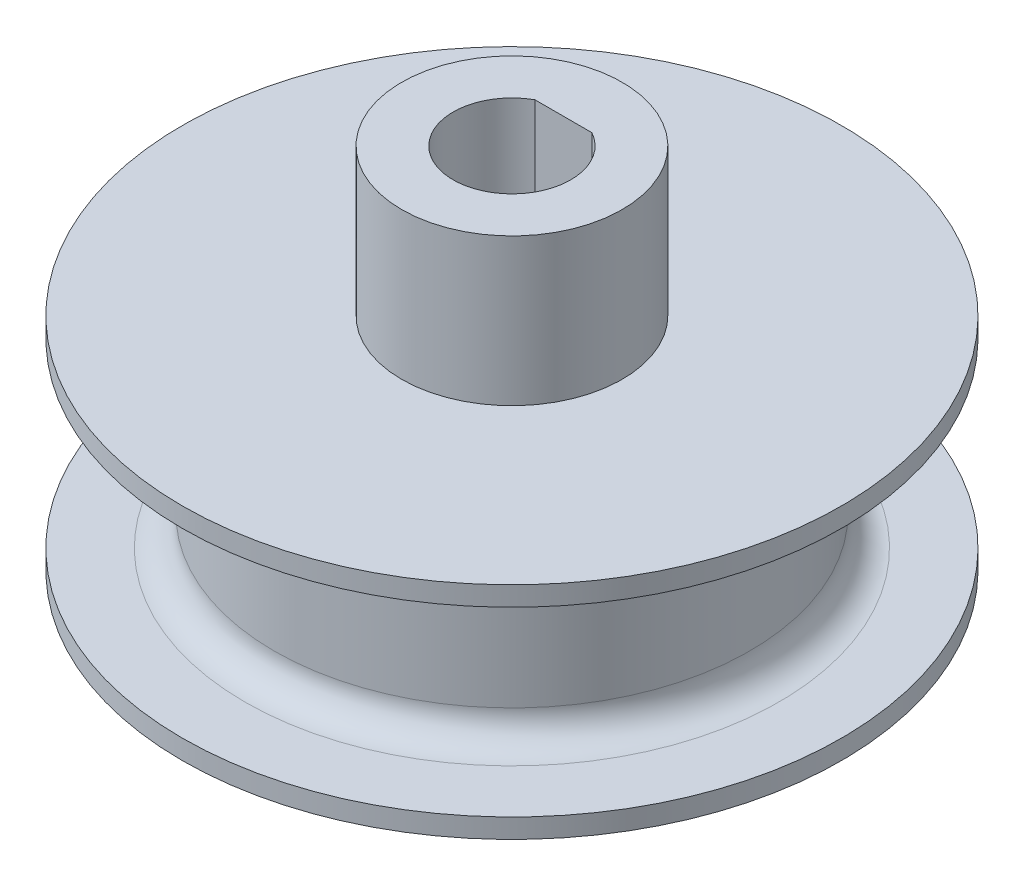
ISO-10303-21;
HEADER;
FILE_DESCRIPTION(('STEP AP214'),'2;1');
FILE_NAME('part.step','',(''),(''),'','','');
FILE_SCHEMA(('AUTOMOTIVE_DESIGN { 1 0 10303 214 1 1 1 1 }'));
ENDSEC;
DATA;
#1=APPLICATION_CONTEXT('core data for automotive mechanical design processes');
#2=APPLICATION_PROTOCOL_DEFINITION('international standard','automotive_design',2000,#1);
#3=PRODUCT_CONTEXT('',#1,'mechanical');
#4=PRODUCT('Part','Part','',(#3));
#5=PRODUCT_RELATED_PRODUCT_CATEGORY('part','',(#4));
#6=PRODUCT_DEFINITION_FORMATION('','',#4);
#7=PRODUCT_DEFINITION_CONTEXT('part definition',#1,'design');
#8=PRODUCT_DEFINITION('design','',#6,#7);
#9=PRODUCT_DEFINITION_SHAPE('','',#8);
#10=(LENGTH_UNIT() NAMED_UNIT(*) SI_UNIT(.MILLI.,.METRE.));
#11=(NAMED_UNIT(*) PLANE_ANGLE_UNIT() SI_UNIT($,.RADIAN.));
#12=(NAMED_UNIT(*) SI_UNIT($,.STERADIAN.) SOLID_ANGLE_UNIT());
#13=UNCERTAINTY_MEASURE_WITH_UNIT(LENGTH_MEASURE(1.E-05),#10,'distance_accuracy_value','');
#14=(GEOMETRIC_REPRESENTATION_CONTEXT(3) GLOBAL_UNCERTAINTY_ASSIGNED_CONTEXT((#13)) GLOBAL_UNIT_ASSIGNED_CONTEXT((#10,
#11,#12)) REPRESENTATION_CONTEXT('',''));
#15=CARTESIAN_POINT('',(0.,0.,0.));
#16=DIRECTION('',(0.,0.,1.));
#17=DIRECTION('',(1.,0.,0.));
#18=AXIS2_PLACEMENT_3D('',#15,#16,#17);
#19=CARTESIAN_POINT('',(0.,7.5,0.));
#20=DIRECTION('',(0.,-1.,0.));
#21=DIRECTION('',(0.,0.,-1.));
#22=AXIS2_PLACEMENT_3D('',#19,#20,#21);
#23=CYLINDRICAL_SURFACE('',#22,4.);
#24=CARTESIAN_POINT('',(0.,-7.5,0.));
#25=DIRECTION('',(0.,1.,0.));
#26=DIRECTION('',(0.,0.,1.));
#27=AXIS2_PLACEMENT_3D('',#24,#25,#26);
#28=CIRCLE('',#27,4.);
#29=CARTESIAN_POINT('',(-1.93649167310371,-7.5,-3.5));
#30=VERTEX_POINT('',#29);
#31=CARTESIAN_POINT('',(1.93649167310371,-7.5,-3.5));
#32=VERTEX_POINT('',#31);
#33=EDGE_CURVE('E71',#30,#32,#28,.T.);
#34=ORIENTED_EDGE('',*,*,#33,.F.);
#35=DIRECTION('',(0.,-1.,0.));
#36=VECTOR('',#35,1.);
#37=CARTESIAN_POINT('',(-1.93649167310371,7.5,-3.5));
#38=LINE('',#37,#36);
#39=CARTESIAN_POINT('',(-1.93649167310371,17.5,-3.5));
#40=VERTEX_POINT('',#39);
#41=EDGE_CURVE('E11',#40,#30,#38,.T.);
#42=ORIENTED_EDGE('',*,*,#41,.F.);
#43=CARTESIAN_POINT('',(0.,17.5,0.));
#44=DIRECTION('',(0.,1.,0.));
#45=DIRECTION('',(0.,0.,1.));
#46=AXIS2_PLACEMENT_3D('',#43,#44,#45);
#47=CIRCLE('',#46,4.);
#48=CARTESIAN_POINT('',(1.93649167310371,17.5,-3.5));
#49=VERTEX_POINT('',#48);
#50=EDGE_CURVE('E70',#40,#49,#47,.T.);
#51=ORIENTED_EDGE('',*,*,#50,.T.);
#52=DIRECTION('',(0.,-1.,0.));
#53=VECTOR('',#52,1.);
#54=CARTESIAN_POINT('',(1.93649167310371,7.5,-3.5));
#55=LINE('',#54,#53);
#56=EDGE_CURVE('E53',#49,#32,#55,.T.);
#57=ORIENTED_EDGE('',*,*,#56,.T.);
#58=EDGE_LOOP('',(#34,#42,#51,#57));
#59=FACE_BOUND('',#58,.T.);
#60=ADVANCED_FACE('F45',(#59),#23,.F.);
#61=CARTESIAN_POINT('',(0.,7.5,-3.5));
#62=DIRECTION('',(0.,0.,1.));
#63=DIRECTION('',(1.,0.,0.));
#64=AXIS2_PLACEMENT_3D('',#61,#62,#63);
#65=PLANE('',#64);
#66=DIRECTION('',(-1.,0.,0.));
#67=VECTOR('',#66,1.);
#68=CARTESIAN_POINT('',(0.,-7.5,-3.5));
#69=LINE('',#68,#67);
#70=EDGE_CURVE('E126',#32,#30,#69,.T.);
#71=ORIENTED_EDGE('',*,*,#70,.F.);
#72=ORIENTED_EDGE('',*,*,#56,.F.);
#73=DIRECTION('',(1.,0.,0.));
#74=VECTOR('',#73,1.);
#75=CARTESIAN_POINT('',(0.,17.5,-3.5));
#76=LINE('',#75,#74);
#77=EDGE_CURVE('E74',#40,#49,#76,.T.);
#78=ORIENTED_EDGE('',*,*,#77,.F.);
#79=ORIENTED_EDGE('',*,*,#41,.T.);
#80=EDGE_LOOP('',(#71,#72,#78,#79));
#81=FACE_BOUND('',#80,.T.);
#82=ADVANCED_FACE('F75',(#81),#65,.T.);
#83=CARTESIAN_POINT('',(0.,7.5,0.));
#84=DIRECTION('',(0.,1.,0.));
#85=DIRECTION('',(0.,0.,1.));
#86=AXIS2_PLACEMENT_3D('',#83,#84,#85);
#87=PLANE('',#86);
#88=CARTESIAN_POINT('',(0.,7.5,0.));
#89=DIRECTION('',(0.,1.,0.));
#90=DIRECTION('',(0.,0.,1.));
#91=AXIS2_PLACEMENT_3D('',#88,#89,#90);
#92=CIRCLE('',#91,7.5);
#93=CARTESIAN_POINT('',(0.,7.5,7.5));
#94=VERTEX_POINT('',#93);
#95=EDGE_CURVE('E83',#94,#94,#92,.T.);
#96=ORIENTED_EDGE('',*,*,#95,.F.);
#97=EDGE_LOOP('',(#96));
#98=FACE_BOUND('',#97,.T.);
#99=CARTESIAN_POINT('',(0.,7.5,0.));
#100=DIRECTION('',(0.,1.,0.));
#101=DIRECTION('',(0.,0.,1.));
#102=AXIS2_PLACEMENT_3D('',#99,#100,#101);
#103=CIRCLE('',#102,22.4137232347134);
#104=CARTESIAN_POINT('',(0.,7.5,22.4137232347134));
#105=VERTEX_POINT('',#104);
#106=EDGE_CURVE('E112',#105,#105,#103,.T.);
#107=ORIENTED_EDGE('',*,*,#106,.T.);
#108=EDGE_LOOP('',(#107));
#109=FACE_BOUND('',#108,.T.);
#110=ADVANCED_FACE('F134',(#98,#109),#87,.T.);
#111=CARTESIAN_POINT('',(0.,-7.5,0.));
#112=DIRECTION('',(0.,1.,0.));
#113=DIRECTION('',(0.,0.,1.));
#114=AXIS2_PLACEMENT_3D('',#111,#112,#113);
#115=PLANE('',#114);
#116=ORIENTED_EDGE('',*,*,#33,.T.);
#117=ORIENTED_EDGE('',*,*,#70,.T.);
#118=EDGE_LOOP('',(#116,#117));
#119=FACE_BOUND('',#118,.T.);
#120=CARTESIAN_POINT('',(0.,-7.5,0.));
#121=DIRECTION('',(0.,1.,0.));
#122=DIRECTION('',(0.,0.,1.));
#123=AXIS2_PLACEMENT_3D('',#120,#121,#122);
#124=CIRCLE('',#123,22.4137232347134);
#125=CARTESIAN_POINT('',(0.,-7.5,22.4137232347134));
#126=VERTEX_POINT('',#125);
#127=EDGE_CURVE('E108',#126,#126,#124,.T.);
#128=ORIENTED_EDGE('',*,*,#127,.F.);
#129=EDGE_LOOP('',(#128));
#130=FACE_BOUND('',#129,.T.);
#131=ADVANCED_FACE('F130',(#119,#130),#115,.F.);
#132=CARTESIAN_POINT('',(0.,4.176007767818,0.));
#133=DIRECTION('',(0.,1.,0.));
#134=DIRECTION('',(0.,0.,1.));
#135=AXIS2_PLACEMENT_3D('',#132,#133,#134);
#136=TOROIDAL_SURFACE('',#135,18.1594784829378,2.);
#137=CARTESIAN_POINT('',(0.,4.176007767818,0.));
#138=DIRECTION('',(0.,1.,0.));
#139=DIRECTION('',(0.,0.,1.));
#140=AXIS2_PLACEMENT_3D('',#137,#138,#139);
#141=CIRCLE('',#140,16.1594784829378);
#142=CARTESIAN_POINT('',(0.,4.176007767818,16.1594784829378));
#143=VERTEX_POINT('',#142);
#144=EDGE_CURVE('E91',#143,#143,#141,.T.);
#145=ORIENTED_EDGE('',*,*,#144,.T.);
#146=EDGE_LOOP('',(#145));
#147=FACE_BOUND('',#146,.T.);
#148=CARTESIAN_POINT('',(0.,6.176007767818,0.));
#149=DIRECTION('',(0.,1.,0.));
#150=DIRECTION('',(0.,0.,1.));
#151=AXIS2_PLACEMENT_3D('',#148,#149,#150);
#152=CIRCLE('',#151,18.1594784829378);
#153=CARTESIAN_POINT('',(0.,6.176007767818,18.1594784829378));
#154=VERTEX_POINT('',#153);
#155=EDGE_CURVE('E120',#154,#154,#152,.T.);
#156=ORIENTED_EDGE('',*,*,#155,.F.);
#157=EDGE_LOOP('',(#156));
#158=FACE_BOUND('',#157,.T.);
#159=ADVANCED_FACE('F133',(#147,#158),#136,.F.);
#160=CARTESIAN_POINT('',(0.,6.176007767818,0.));
#161=DIRECTION('',(0.,-1.,0.));
#162=DIRECTION('',(0.,0.,-1.));
#163=AXIS2_PLACEMENT_3D('',#160,#161,#162);
#164=PLANE('',#163);
#165=ORIENTED_EDGE('',*,*,#155,.T.);
#166=EDGE_LOOP('',(#165));
#167=FACE_BOUND('',#166,.T.);
#168=CARTESIAN_POINT('',(0.,6.176007767818,0.));
#169=DIRECTION('',(0.,1.,0.));
#170=DIRECTION('',(0.,0.,1.));
#171=AXIS2_PLACEMENT_3D('',#168,#169,#170);
#172=CIRCLE('',#171,22.4137232347134);
#173=CARTESIAN_POINT('',(0.,6.176007767818,22.4137232347134));
#174=VERTEX_POINT('',#173);
#175=EDGE_CURVE('E116',#174,#174,#172,.T.);
#176=ORIENTED_EDGE('',*,*,#175,.F.);
#177=EDGE_LOOP('',(#176));
#178=FACE_BOUND('',#177,.T.);
#179=ADVANCED_FACE('F166',(#167,#178),#164,.T.);
#180=CARTESIAN_POINT('',(0.,7.5,0.));
#181=DIRECTION('',(0.,1.,0.));
#182=DIRECTION('',(0.,0.,1.));
#183=AXIS2_PLACEMENT_3D('',#180,#181,#182);
#184=CYLINDRICAL_SURFACE('',#183,22.4137232347134);
#185=ORIENTED_EDGE('',*,*,#175,.T.);
#186=EDGE_LOOP('',(#185));
#187=FACE_BOUND('',#186,.T.);
#188=ORIENTED_EDGE('',*,*,#106,.F.);
#189=EDGE_LOOP('',(#188));
#190=FACE_BOUND('',#189,.T.);
#191=ADVANCED_FACE('F142',(#187,#190),#184,.T.);
#192=CARTESIAN_POINT('',(0.,7.5,0.));
#193=DIRECTION('',(0.,1.,0.));
#194=DIRECTION('',(0.,0.,1.));
#195=AXIS2_PLACEMENT_3D('',#192,#193,#194);
#196=CYLINDRICAL_SURFACE('',#195,22.4137232347134);
#197=ORIENTED_EDGE('',*,*,#127,.T.);
#198=EDGE_LOOP('',(#197));
#199=FACE_BOUND('',#198,.T.);
#200=CARTESIAN_POINT('',(0.,-6.176007767818,0.));
#201=DIRECTION('',(0.,1.,0.));
#202=DIRECTION('',(0.,0.,1.));
#203=AXIS2_PLACEMENT_3D('',#200,#201,#202);
#204=CIRCLE('',#203,22.4137232347134);
#205=CARTESIAN_POINT('',(0.,-6.176007767818,22.4137232347134));
#206=VERTEX_POINT('',#205);
#207=EDGE_CURVE('E104',#206,#206,#204,.T.);
#208=ORIENTED_EDGE('',*,*,#207,.F.);
#209=EDGE_LOOP('',(#208));
#210=FACE_BOUND('',#209,.T.);
#211=ADVANCED_FACE('F138',(#199,#210),#196,.T.);
#212=CARTESIAN_POINT('',(0.,-6.176007767818,0.));
#213=DIRECTION('',(0.,1.,0.));
#214=DIRECTION('',(0.,0.,1.));
#215=AXIS2_PLACEMENT_3D('',#212,#213,#214);
#216=PLANE('',#215);
#217=ORIENTED_EDGE('',*,*,#207,.T.);
#218=EDGE_LOOP('',(#217));
#219=FACE_BOUND('',#218,.T.);
#220=CARTESIAN_POINT('',(0.,-6.176007767818,0.));
#221=DIRECTION('',(0.,1.,0.));
#222=DIRECTION('',(0.,0.,1.));
#223=AXIS2_PLACEMENT_3D('',#220,#221,#222);
#224=CIRCLE('',#223,18.1594784829378);
#225=CARTESIAN_POINT('',(0.,-6.176007767818,18.1594784829378));
#226=VERTEX_POINT('',#225);
#227=EDGE_CURVE('E100',#226,#226,#224,.T.);
#228=ORIENTED_EDGE('',*,*,#227,.F.);
#229=EDGE_LOOP('',(#228));
#230=FACE_BOUND('',#229,.T.);
#231=ADVANCED_FACE('F141',(#219,#230),#216,.T.);
#232=CARTESIAN_POINT('',(0.,-4.176007767818,0.));
#233=DIRECTION('',(0.,1.,0.));
#234=DIRECTION('',(0.,0.,1.));
#235=AXIS2_PLACEMENT_3D('',#232,#233,#234);
#236=TOROIDAL_SURFACE('',#235,18.1594784829378,2.);
#237=ORIENTED_EDGE('',*,*,#227,.T.);
#238=EDGE_LOOP('',(#237));
#239=FACE_BOUND('',#238,.T.);
#240=CARTESIAN_POINT('',(0.,-4.176007767818,0.));
#241=DIRECTION('',(0.,1.,0.));
#242=DIRECTION('',(0.,0.,1.));
#243=AXIS2_PLACEMENT_3D('',#240,#241,#242);
#244=CIRCLE('',#243,16.1594784829378);
#245=CARTESIAN_POINT('',(0.,-4.176007767818,16.1594784829378));
#246=VERTEX_POINT('',#245);
#247=EDGE_CURVE('E96',#246,#246,#244,.T.);
#248=ORIENTED_EDGE('',*,*,#247,.F.);
#249=EDGE_LOOP('',(#248));
#250=FACE_BOUND('',#249,.T.);
#251=ADVANCED_FACE('F148',(#239,#250),#236,.F.);
#252=CARTESIAN_POINT('',(0.,7.5,0.));
#253=DIRECTION('',(0.,1.,0.));
#254=DIRECTION('',(0.,0.,1.));
#255=AXIS2_PLACEMENT_3D('',#252,#253,#254);
#256=CYLINDRICAL_SURFACE('',#255,16.1594784829378);
#257=ORIENTED_EDGE('',*,*,#247,.T.);
#258=EDGE_LOOP('',(#257));
#259=FACE_BOUND('',#258,.T.);
#260=ORIENTED_EDGE('',*,*,#144,.F.);
#261=EDGE_LOOP('',(#260));
#262=FACE_BOUND('',#261,.T.);
#263=ADVANCED_FACE('F154',(#259,#262),#256,.T.);
#264=CARTESIAN_POINT('',(0.,17.5,0.));
#265=DIRECTION('',(0.,-1.,0.));
#266=DIRECTION('',(0.,0.,-1.));
#267=AXIS2_PLACEMENT_3D('',#264,#265,#266);
#268=CYLINDRICAL_SURFACE('',#267,7.5);
#269=CARTESIAN_POINT('',(0.,17.5,0.));
#270=DIRECTION('',(0.,1.,0.));
#271=DIRECTION('',(0.,0.,1.));
#272=AXIS2_PLACEMENT_3D('',#269,#270,#271);
#273=CIRCLE('',#272,7.5);
#274=CARTESIAN_POINT('',(0.,17.5,7.5));
#275=VERTEX_POINT('',#274);
#276=EDGE_CURVE('E78',#275,#275,#273,.T.);
#277=ORIENTED_EDGE('',*,*,#276,.F.);
#278=EDGE_LOOP('',(#277));
#279=FACE_BOUND('',#278,.T.);
#280=ORIENTED_EDGE('',*,*,#95,.T.);
#281=EDGE_LOOP('',(#280));
#282=FACE_BOUND('',#281,.T.);
#283=ADVANCED_FACE('F160',(#279,#282),#268,.T.);
#284=CARTESIAN_POINT('',(0.,17.5,0.));
#285=DIRECTION('',(0.,1.,0.));
#286=DIRECTION('',(0.,0.,1.));
#287=AXIS2_PLACEMENT_3D('',#284,#285,#286);
#288=PLANE('',#287);
#289=ORIENTED_EDGE('',*,*,#50,.F.);
#290=ORIENTED_EDGE('',*,*,#77,.T.);
#291=EDGE_LOOP('',(#289,#290));
#292=FACE_BOUND('',#291,.T.);
#293=ORIENTED_EDGE('',*,*,#276,.T.);
#294=EDGE_LOOP('',(#293));
#295=FACE_BOUND('',#294,.T.);
#296=ADVANCED_FACE('F80',(#292,#295),#288,.T.);
#297=CLOSED_SHELL('',(#60,#82,#110,#131,#159,#179,#191,#211,#231,#251,#263,#283,#296));
#298=MANIFOLD_SOLID_BREP('B2',#297);
#299=ADVANCED_BREP_SHAPE_REPRESENTATION('',(#18,#298),#14);
#300=SHAPE_DEFINITION_REPRESENTATION(#9,#299);
ENDSEC;
END-ISO-10303-21;
